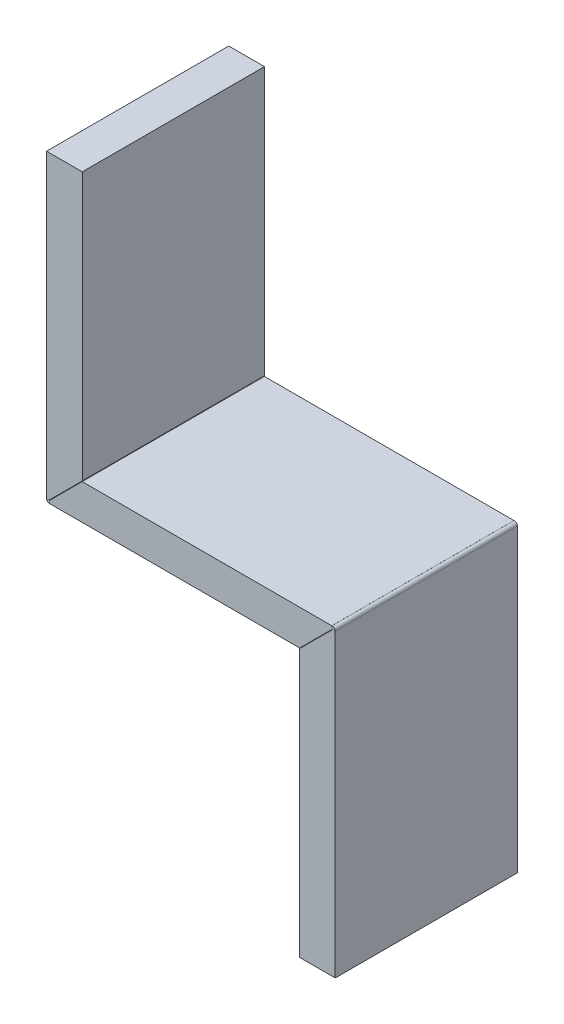
ISO-10303-21;
HEADER;
FILE_DESCRIPTION(('STEP AP214'),'2;1');
FILE_NAME('part.step','',(''),(''),'','','');
FILE_SCHEMA(('AUTOMOTIVE_DESIGN { 1 0 10303 214 1 1 1 1 }'));
ENDSEC;
DATA;
#1=APPLICATION_CONTEXT('core data for automotive mechanical design processes');
#2=APPLICATION_PROTOCOL_DEFINITION('international standard','automotive_design',2000,#1);
#3=PRODUCT_CONTEXT('',#1,'mechanical');
#4=PRODUCT('Part','Part','',(#3));
#5=PRODUCT_RELATED_PRODUCT_CATEGORY('part','',(#4));
#6=PRODUCT_DEFINITION_FORMATION('','',#4);
#7=PRODUCT_DEFINITION_CONTEXT('part definition',#1,'design');
#8=PRODUCT_DEFINITION('design','',#6,#7);
#9=PRODUCT_DEFINITION_SHAPE('','',#8);
#10=(LENGTH_UNIT() NAMED_UNIT(*) SI_UNIT(.MILLI.,.METRE.));
#11=(NAMED_UNIT(*) PLANE_ANGLE_UNIT() SI_UNIT($,.RADIAN.));
#12=(NAMED_UNIT(*) SI_UNIT($,.STERADIAN.) SOLID_ANGLE_UNIT());
#13=UNCERTAINTY_MEASURE_WITH_UNIT(LENGTH_MEASURE(1.E-05),#10,'distance_accuracy_value','');
#14=(GEOMETRIC_REPRESENTATION_CONTEXT(3) GLOBAL_UNCERTAINTY_ASSIGNED_CONTEXT((#13)) GLOBAL_UNIT_ASSIGNED_CONTEXT((#10,
#11,#12)) REPRESENTATION_CONTEXT('',''));
#15=CARTESIAN_POINT('',(0.,0.,0.));
#16=DIRECTION('',(0.,0.,1.));
#17=DIRECTION('',(1.,0.,0.));
#18=AXIS2_PLACEMENT_3D('',#15,#16,#17);
#19=CARTESIAN_POINT('',(0.0913976183315616,-4.99476189853523,1.));
#20=DIRECTION('',(-0.114247022914439,0.993452373169035,0.));
#21=DIRECTION('',(-0.993452373169035,-0.114247022914439,0.));
#22=AXIS2_PLACEMENT_3D('',#19,#20,#21);
#23=PLANE('',#22);
#24=DIRECTION('',(0.993452373169035,0.114247022914439,0.));
#25=VECTOR('',#24,1.);
#26=CARTESIAN_POINT('',(0.0913976183315616,-4.99476189853523,-50.));
#27=LINE('',#26,#25);
#28=CARTESIAN_POINT('',(0.102540088560706,-4.99348051445888,-50.));
#29=VERTEX_POINT('',#28);
#30=CARTESIAN_POINT('',(0.189496610299924,-4.98348051445888,-50.));
#31=VERTEX_POINT('',#30);
#32=EDGE_CURVE('E326',#29,#31,#27,.T.);
#33=ORIENTED_EDGE('',*,*,#32,.T.);
#34=DIRECTION('',(0.,0.,1.));
#35=VECTOR('',#34,1.);
#36=CARTESIAN_POINT('',(0.189496610299924,-4.98348051445888,-134.533631884125));
#37=LINE('',#36,#35);
#38=CARTESIAN_POINT('',(0.189496610299924,-4.98348051445888,1.));
#39=VERTEX_POINT('',#38);
#40=EDGE_CURVE('E248',#31,#39,#37,.T.);
#41=ORIENTED_EDGE('',*,*,#40,.T.);
#42=DIRECTION('',(0.993452373169035,0.114247022914439,0.));
#43=VECTOR('',#42,1.);
#44=CARTESIAN_POINT('',(0.0913976183315616,-4.99476189853523,1.));
#45=LINE('',#44,#43);
#46=CARTESIAN_POINT('',(0.102540088560706,-4.99348051445888,1.));
#47=VERTEX_POINT('',#46);
#48=EDGE_CURVE('E359',#47,#39,#45,.T.);
#49=ORIENTED_EDGE('',*,*,#48,.F.);
#50=DIRECTION('',(0.,0.,-1.));
#51=VECTOR('',#50,1.);
#52=CARTESIAN_POINT('',(0.102540088560706,-4.99348051445888,1.));
#53=LINE('',#52,#51);
#54=EDGE_CURVE('E370',#47,#29,#53,.T.);
#55=ORIENTED_EDGE('',*,*,#54,.T.);
#56=EDGE_LOOP('',(#33,#41,#49,#55));
#57=FACE_BOUND('',#56,.T.);
#58=ADVANCED_FACE('F37',(#57),#23,.F.);
#59=CARTESIAN_POINT('',(0.,-4.2,1.));
#60=DIRECTION('',(-0.114247022914439,0.993452373169035,0.));
#61=DIRECTION('',(-0.993452373169035,-0.114247022914439,0.));
#62=AXIS2_PLACEMENT_3D('',#59,#60,#61);
#63=PLANE('',#62);
#64=DIRECTION('',(0.,0.,1.));
#65=VECTOR('',#64,1.);
#66=CARTESIAN_POINT('',(0.0707496126192965,-4.19186379454878,-50.));
#67=LINE('',#66,#65);
#68=CARTESIAN_POINT('',(0.0707496126192966,-4.19186379454878,-50.));
#69=VERTEX_POINT('',#68);
#70=CARTESIAN_POINT('',(0.0707496126192966,-4.19186379454878,1.));
#71=VERTEX_POINT('',#70);
#72=EDGE_CURVE('E272',#69,#71,#67,.T.);
#73=ORIENTED_EDGE('',*,*,#72,.F.);
#74=DIRECTION('',(0.993452373169035,0.114247022914439,0.));
#75=VECTOR('',#74,1.);
#76=CARTESIAN_POINT('',(0.,-4.2,-50.));
#77=LINE('',#76,#75);
#78=CARTESIAN_POINT('',(0.0111424702291546,-4.19871861592365,-50.));
#79=VERTEX_POINT('',#78);
#80=EDGE_CURVE('E309',#79,#69,#77,.T.);
#81=ORIENTED_EDGE('',*,*,#80,.F.);
#82=DIRECTION('',(0.,0.,-1.));
#83=VECTOR('',#82,1.);
#84=CARTESIAN_POINT('',(0.0111424702291546,-4.19871861592365,1.));
#85=LINE('',#84,#83);
#86=CARTESIAN_POINT('',(0.0111424702291546,-4.19871861592365,1.));
#87=VERTEX_POINT('',#86);
#88=EDGE_CURVE('E381',#87,#79,#85,.T.);
#89=ORIENTED_EDGE('',*,*,#88,.F.);
#90=DIRECTION('',(0.993452373169035,0.114247022914439,0.));
#91=VECTOR('',#90,1.);
#92=CARTESIAN_POINT('',(0.,-4.2,1.));
#93=LINE('',#92,#91);
#94=EDGE_CURVE('E343',#87,#71,#93,.T.);
#95=ORIENTED_EDGE('',*,*,#94,.T.);
#96=EDGE_LOOP('',(#73,#81,#89,#95));
#97=FACE_BOUND('',#96,.T.);
#98=ADVANCED_FACE('F425',(#97),#63,.T.);
#99=CARTESIAN_POINT('',(0.0111424702291546,-4.19871861592365,1.));
#100=DIRECTION('',(0.,0.,1.));
#101=DIRECTION('',(1.,0.,0.));
#102=AXIS2_PLACEMENT_3D('',#99,#100,#101);
#103=PLANE('',#102);
#104=DIRECTION('',(0.114247022914439,-0.993452373169035,0.));
#105=VECTOR('',#104,1.);
#106=CARTESIAN_POINT('',(0.0111424702291546,-4.19871861592365,1.));
#107=LINE('',#106,#105);
#108=EDGE_CURVE('E11',#87,#47,#107,.T.);
#109=ORIENTED_EDGE('',*,*,#108,.F.);
#110=CARTESIAN_POINT('',(0.0100000000000104,-4.18878409219196,1.));
#111=DIRECTION('',(0.,0.,-1.));
#112=DIRECTION('',(-1.,0.,0.));
#113=AXIS2_PLACEMENT_3D('',#110,#111,#112);
#114=CIRCLE('',#113,0.01);
#115=CARTESIAN_POINT('',(0.,-4.18878409219196,1.));
#116=VERTEX_POINT('',#115);
#117=EDGE_CURVE('E345',#116,#87,#114,.F.);
#118=ORIENTED_EDGE('',*,*,#117,.F.);
#119=DIRECTION('',(1.,2.60208521396521E-13,0.));
#120=VECTOR('',#119,1.);
#121=CARTESIAN_POINT('',(-0.79999999999999,-4.18878409219217,1.));
#122=LINE('',#121,#120);
#123=CARTESIAN_POINT('',(-0.79999999999999,-4.18878409219217,1.));
#124=VERTEX_POINT('',#123);
#125=EDGE_CURVE('E45',#124,#116,#122,.T.);
#126=ORIENTED_EDGE('',*,*,#125,.F.);
#127=CARTESIAN_POINT('',(0.0100000000000104,-4.18878409219196,1.));
#128=DIRECTION('',(0.,0.,1.));
#129=DIRECTION('',(1.,0.,0.));
#130=AXIS2_PLACEMENT_3D('',#127,#128,#129);
#131=CIRCLE('',#130,0.81);
#132=EDGE_CURVE('E355',#124,#47,#131,.T.);
#133=ORIENTED_EDGE('',*,*,#132,.T.);
#134=EDGE_LOOP('',(#109,#118,#126,#133));
#135=FACE_BOUND('',#134,.T.);
#136=ADVANCED_FACE('F39',(#135),#103,.T.);
#137=CARTESIAN_POINT('',(-0.79999999999999,-4.18878409219217,1.));
#138=DIRECTION('',(0.,0.,1.));
#139=DIRECTION('',(1.,0.,0.));
#140=AXIS2_PLACEMENT_3D('',#137,#138,#139);
#141=PLANE('',#140);
#142=ORIENTED_EDGE('',*,*,#94,.F.);
#143=ORIENTED_EDGE('',*,*,#108,.T.);
#144=ORIENTED_EDGE('',*,*,#48,.T.);
#145=DIRECTION('',(0.,-1.,0.));
#146=VECTOR('',#145,1.);
#147=CARTESIAN_POINT('',(0.189496610299924,-4.98348051445888,1.));
#148=LINE('',#147,#146);
#149=CARTESIAN_POINT('',(0.189496610299924,-4.99348051445888,1.));
#150=VERTEX_POINT('',#149);
#151=EDGE_CURVE('E227',#39,#150,#148,.T.);
#152=ORIENTED_EDGE('',*,*,#151,.T.);
#153=DIRECTION('',(1.,0.,0.));
#154=VECTOR('',#153,1.);
#155=CARTESIAN_POINT('',(0.189496610299924,-4.99348051445888,1.));
#156=LINE('',#155,#154);
#157=CARTESIAN_POINT('',(70.0408310240318,-4.99348051445888,1.));
#158=VERTEX_POINT('',#157);
#159=EDGE_CURVE('E232',#150,#158,#156,.T.);
#160=ORIENTED_EDGE('',*,*,#159,.T.);
#161=DIRECTION('',(0.707106781186543,0.707106781186552,0.));
#162=VECTOR('',#161,1.);
#163=CARTESIAN_POINT('',(70.0408310240318,-4.99348051445888,1.));
#164=LINE('',#163,#162);
#165=CARTESIAN_POINT('',(79.1288575297708,4.09454599128029,1.));
#166=VERTEX_POINT('',#165);
#167=EDGE_CURVE('E228',#158,#166,#164,.T.);
#168=ORIENTED_EDGE('',*,*,#167,.T.);
#169=CARTESIAN_POINT('',(79.1888575297708,4.10144599128029,1.));
#170=VERTEX_POINT('',#169);
#171=EDGE_CURVE('E358',#166,#170,#45,.T.);
#172=ORIENTED_EDGE('',*,*,#171,.T.);
#173=DIRECTION('',(-0.114247022914484,0.99345237316903,0.));
#174=VECTOR('',#173,1.);
#175=CARTESIAN_POINT('',(79.1888575297708,4.10144599128029,1.));
#176=LINE('',#175,#174);
#177=CARTESIAN_POINT('',(79.0974599114393,4.89620788981551,1.));
#178=VERTEX_POINT('',#177);
#179=EDGE_CURVE('E397',#170,#178,#176,.T.);
#180=ORIENTED_EDGE('',*,*,#179,.T.);
#181=CARTESIAN_POINT('',(79.0105033897001,4.88620788981551,1.));
#182=VERTEX_POINT('',#181);
#183=EDGE_CURVE('E342',#182,#178,#93,.T.);
#184=ORIENTED_EDGE('',*,*,#183,.F.);
#185=DIRECTION('',(0.,1.,0.));
#186=VECTOR('',#185,1.);
#187=CARTESIAN_POINT('',(79.0105033897001,4.89620788981551,1.));
#188=LINE('',#187,#186);
#189=CARTESIAN_POINT('',(79.0105033897001,4.89620788981551,1.));
#190=VERTEX_POINT('',#189);
#191=EDGE_CURVE('E253',#182,#190,#188,.T.);
#192=ORIENTED_EDGE('',*,*,#191,.T.);
#193=DIRECTION('',(-1.,0.,0.));
#194=VECTOR('',#193,1.);
#195=CARTESIAN_POINT('',(9.1588212969835,4.89620788981551,1.));
#196=LINE('',#195,#194);
#197=CARTESIAN_POINT('',(9.1588212969835,4.89620788981551,1.));
#198=VERTEX_POINT('',#197);
#199=EDGE_CURVE('E267',#190,#198,#196,.T.);
#200=ORIENTED_EDGE('',*,*,#199,.T.);
#201=DIRECTION('',(-0.707106781186544,-0.707106781186551,0.));
#202=VECTOR('',#201,1.);
#203=CARTESIAN_POINT('',(0.0707496126192965,-4.19186379454878,1.));
#204=LINE('',#203,#202);
#205=EDGE_CURVE('E258',#198,#71,#204,.T.);
#206=ORIENTED_EDGE('',*,*,#205,.T.);
#207=EDGE_LOOP('',(#142,#143,#144,#152,#160,#168,#172,#180,#184,#192,#200,#206));
#208=FACE_BOUND('',#207,.T.);
#209=ADVANCED_FACE('F426',(#208),#141,.T.);
#210=CARTESIAN_POINT('',(0.,-4.18878409219196,-50.));
#211=DIRECTION('',(0.,0.,-1.));
#212=DIRECTION('',(-1.,0.,0.));
#213=AXIS2_PLACEMENT_3D('',#210,#211,#212);
#214=PLANE('',#213);
#215=DIRECTION('',(-1.,-2.60208521396521E-13,0.));
#216=VECTOR('',#215,1.);
#217=CARTESIAN_POINT('',(0.,-4.18878409219196,-50.));
#218=LINE('',#217,#216);
#219=CARTESIAN_POINT('',(0.,-4.18878409219196,-50.));
#220=VERTEX_POINT('',#219);
#221=CARTESIAN_POINT('',(-0.79999999999999,-4.18878409219217,-50.));
#222=VERTEX_POINT('',#221);
#223=EDGE_CURVE('E404',#220,#222,#218,.T.);
#224=ORIENTED_EDGE('',*,*,#223,.F.);
#225=CARTESIAN_POINT('',(0.0100000000000104,-4.18878409219196,-50.));
#226=DIRECTION('',(0.,0.,-1.));
#227=DIRECTION('',(-1.,0.,0.));
#228=AXIS2_PLACEMENT_3D('',#225,#226,#227);
#229=CIRCLE('',#228,0.01);
#230=EDGE_CURVE('E312',#220,#79,#229,.F.);
#231=ORIENTED_EDGE('',*,*,#230,.T.);
#232=DIRECTION('',(-0.114247022914439,0.993452373169035,0.));
#233=VECTOR('',#232,1.);
#234=CARTESIAN_POINT('',(0.102540088560706,-4.99348051445888,-50.));
#235=LINE('',#234,#233);
#236=EDGE_CURVE('E402',#29,#79,#235,.T.);
#237=ORIENTED_EDGE('',*,*,#236,.F.);
#238=CARTESIAN_POINT('',(0.0100000000000104,-4.18878409219196,-50.));
#239=DIRECTION('',(0.,0.,1.));
#240=DIRECTION('',(1.,0.,0.));
#241=AXIS2_PLACEMENT_3D('',#238,#239,#240);
#242=CIRCLE('',#241,0.81);
#243=EDGE_CURVE('E322',#222,#29,#242,.T.);
#244=ORIENTED_EDGE('',*,*,#243,.F.);
#245=EDGE_LOOP('',(#224,#231,#237,#244));
#246=FACE_BOUND('',#245,.T.);
#247=ADVANCED_FACE('F439',(#246),#214,.T.);
#248=CARTESIAN_POINT('',(0.102540088560706,-4.99348051445888,-50.));
#249=DIRECTION('',(0.,0.,-1.));
#250=DIRECTION('',(-1.,0.,0.));
#251=AXIS2_PLACEMENT_3D('',#248,#249,#250);
#252=PLANE('',#251);
#253=DIRECTION('',(1.,0.,0.));
#254=VECTOR('',#253,1.);
#255=CARTESIAN_POINT('',(-0.800000000000004,80.,-50.));
#256=LINE('',#255,#254);
#257=CARTESIAN_POINT('',(-0.800000000000004,80.,-50.));
#258=VERTEX_POINT('',#257);
#259=CARTESIAN_POINT('',(9.2,80.,-50.));
#260=VERTEX_POINT('',#259);
#261=EDGE_CURVE('E317',#258,#260,#256,.T.);
#262=ORIENTED_EDGE('',*,*,#261,.T.);
#263=DIRECTION('',(0.,1.,0.));
#264=VECTOR('',#263,1.);
#265=CARTESIAN_POINT('',(9.2,80.,-50.));
#266=LINE('',#265,#264);
#267=CARTESIAN_POINT('',(9.2,5.07121590780815,-50.));
#268=VERTEX_POINT('',#267);
#269=EDGE_CURVE('E285',#268,#260,#266,.T.);
#270=ORIENTED_EDGE('',*,*,#269,.F.);
#271=DIRECTION('',(0.707106781186543,0.707106781186552,0.));
#272=VECTOR('',#271,1.);
#273=CARTESIAN_POINT('',(9.2,5.07121590780815,-50.));
#274=LINE('',#273,#272);
#275=CARTESIAN_POINT('',(0.,-4.12878409219196,-50.));
#276=VERTEX_POINT('',#275);
#277=EDGE_CURVE('E282',#276,#268,#274,.T.);
#278=ORIENTED_EDGE('',*,*,#277,.F.);
#279=DIRECTION('',(0.,-1.,0.));
#280=VECTOR('',#279,1.);
#281=CARTESIAN_POINT('',(0.,80.,-50.));
#282=LINE('',#281,#280);
#283=EDGE_CURVE('E315',#276,#220,#282,.T.);
#284=ORIENTED_EDGE('',*,*,#283,.T.);
#285=ORIENTED_EDGE('',*,*,#223,.T.);
#286=DIRECTION('',(0.,-1.,0.));
#287=VECTOR('',#286,1.);
#288=CARTESIAN_POINT('',(-0.800000000000004,80.,-50.));
#289=LINE('',#288,#287);
#290=EDGE_CURVE('E319',#258,#222,#289,.T.);
#291=ORIENTED_EDGE('',*,*,#290,.F.);
#292=EDGE_LOOP('',(#262,#270,#278,#284,#285,#291));
#293=FACE_BOUND('',#292,.T.);
#294=ADVANCED_FACE('F449',(#293),#252,.T.);
#295=CARTESIAN_POINT('',(80.,4.0915114675486,1.));
#296=DIRECTION('',(0.,0.,1.));
#297=DIRECTION('',(1.,0.,0.));
#298=AXIS2_PLACEMENT_3D('',#295,#296,#297);
#299=PLANE('',#298);
#300=DIRECTION('',(-1.,0.,0.));
#301=VECTOR('',#300,1.);
#302=CARTESIAN_POINT('',(80.,4.0915114675486,1.));
#303=LINE('',#302,#301);
#304=CARTESIAN_POINT('',(80.,4.0915114675486,1.));
#305=VERTEX_POINT('',#304);
#306=CARTESIAN_POINT('',(79.2,4.0915114675486,1.));
#307=VERTEX_POINT('',#306);
#308=EDGE_CURVE('E400',#305,#307,#303,.T.);
#309=ORIENTED_EDGE('',*,*,#308,.F.);
#310=CARTESIAN_POINT('',(79.19,4.0915114675486,1.));
#311=DIRECTION('',(0.,0.,1.));
#312=DIRECTION('',(1.,0.,0.));
#313=AXIS2_PLACEMENT_3D('',#310,#311,#312);
#314=CIRCLE('',#313,0.81);
#315=EDGE_CURVE('E339',#178,#305,#314,.F.);
#316=ORIENTED_EDGE('',*,*,#315,.F.);
#317=ORIENTED_EDGE('',*,*,#179,.F.);
#318=CARTESIAN_POINT('',(79.19,4.0915114675486,1.));
#319=DIRECTION('',(0.,0.,1.));
#320=DIRECTION('',(1.,0.,0.));
#321=AXIS2_PLACEMENT_3D('',#318,#319,#320);
#322=CIRCLE('',#321,0.01);
#323=EDGE_CURVE('E362',#170,#307,#322,.F.);
#324=ORIENTED_EDGE('',*,*,#323,.T.);
#325=EDGE_LOOP('',(#309,#316,#317,#324));
#326=FACE_BOUND('',#325,.T.);
#327=ADVANCED_FACE('F499',(#326),#299,.T.);
#328=CARTESIAN_POINT('',(79.1888575297708,4.10144599128029,1.));
#329=DIRECTION('',(0.,0.,1.));
#330=DIRECTION('',(1.,0.,0.));
#331=AXIS2_PLACEMENT_3D('',#328,#329,#330);
#332=PLANE('',#331);
#333=DIRECTION('',(0.,-1.,0.));
#334=VECTOR('',#333,1.);
#335=CARTESIAN_POINT('',(80.,5.,1.));
#336=LINE('',#335,#334);
#337=CARTESIAN_POINT('',(80.,-80.,1.));
#338=VERTEX_POINT('',#337);
#339=EDGE_CURVE('E336',#305,#338,#336,.T.);
#340=ORIENTED_EDGE('',*,*,#339,.F.);
#341=ORIENTED_EDGE('',*,*,#308,.T.);
#342=DIRECTION('',(0.,-1.,0.));
#343=VECTOR('',#342,1.);
#344=CARTESIAN_POINT('',(79.2,5.,1.));
#345=LINE('',#344,#343);
#346=CARTESIAN_POINT('',(79.2,4.0315114675486,1.));
#347=VERTEX_POINT('',#346);
#348=EDGE_CURVE('E332',#307,#347,#345,.T.);
#349=ORIENTED_EDGE('',*,*,#348,.T.);
#350=DIRECTION('',(-0.707106781186543,-0.707106781186551,0.));
#351=VECTOR('',#350,1.);
#352=CARTESIAN_POINT('',(79.2,4.0315114675486,1.));
#353=LINE('',#352,#351);
#354=CARTESIAN_POINT('',(70.,-5.1684885324515,1.));
#355=VERTEX_POINT('',#354);
#356=EDGE_CURVE('E221',#347,#355,#353,.T.);
#357=ORIENTED_EDGE('',*,*,#356,.T.);
#358=DIRECTION('',(0.,-1.,0.));
#359=VECTOR('',#358,1.);
#360=CARTESIAN_POINT('',(70.,-5.1684885324515,1.));
#361=LINE('',#360,#359);
#362=CARTESIAN_POINT('',(70.,-80.,1.));
#363=VERTEX_POINT('',#362);
#364=EDGE_CURVE('E214',#355,#363,#361,.T.);
#365=ORIENTED_EDGE('',*,*,#364,.T.);
#366=DIRECTION('',(-1.,0.,0.));
#367=VECTOR('',#366,1.);
#368=CARTESIAN_POINT('',(80.,-80.,1.));
#369=LINE('',#368,#367);
#370=EDGE_CURVE('E334',#338,#363,#369,.T.);
#371=ORIENTED_EDGE('',*,*,#370,.F.);
#372=EDGE_LOOP('',(#340,#341,#349,#357,#365,#371));
#373=FACE_BOUND('',#372,.T.);
#374=ADVANCED_FACE('F521',(#373),#332,.T.);
#375=CARTESIAN_POINT('',(79.0974599114393,4.89620788981551,-50.));
#376=DIRECTION('',(0.,0.,-1.));
#377=DIRECTION('',(-1.,0.,0.));
#378=AXIS2_PLACEMENT_3D('',#375,#376,#377);
#379=PLANE('',#378);
#380=DIRECTION('',(0.114247022914484,-0.99345237316903,0.));
#381=VECTOR('',#380,1.);
#382=CARTESIAN_POINT('',(79.0974599114393,4.89620788981551,-50.));
#383=LINE('',#382,#381);
#384=CARTESIAN_POINT('',(79.0974599114393,4.89620788981551,-50.));
#385=VERTEX_POINT('',#384);
#386=CARTESIAN_POINT('',(79.1888575297708,4.10144599128029,-50.));
#387=VERTEX_POINT('',#386);
#388=EDGE_CURVE('E394',#385,#387,#383,.T.);
#389=ORIENTED_EDGE('',*,*,#388,.F.);
#390=CARTESIAN_POINT('',(79.19,4.0915114675486,-50.));
#391=DIRECTION('',(0.,0.,1.));
#392=DIRECTION('',(1.,0.,0.));
#393=AXIS2_PLACEMENT_3D('',#390,#391,#392);
#394=CIRCLE('',#393,0.81);
#395=CARTESIAN_POINT('',(80.,4.0915114675486,-50.));
#396=VERTEX_POINT('',#395);
#397=EDGE_CURVE('E305',#385,#396,#394,.F.);
#398=ORIENTED_EDGE('',*,*,#397,.T.);
#399=DIRECTION('',(1.,0.,0.));
#400=VECTOR('',#399,1.);
#401=CARTESIAN_POINT('',(79.2,4.0915114675486,-50.));
#402=LINE('',#401,#400);
#403=CARTESIAN_POINT('',(79.2,4.0915114675486,-50.));
#404=VERTEX_POINT('',#403);
#405=EDGE_CURVE('E392',#404,#396,#402,.T.);
#406=ORIENTED_EDGE('',*,*,#405,.F.);
#407=CARTESIAN_POINT('',(79.19,4.0915114675486,-50.));
#408=DIRECTION('',(0.,0.,1.));
#409=DIRECTION('',(1.,0.,0.));
#410=AXIS2_PLACEMENT_3D('',#407,#408,#409);
#411=CIRCLE('',#410,0.01);
#412=EDGE_CURVE('E329',#387,#404,#411,.F.);
#413=ORIENTED_EDGE('',*,*,#412,.F.);
#414=EDGE_LOOP('',(#389,#398,#406,#413));
#415=FACE_BOUND('',#414,.T.);
#416=ADVANCED_FACE('F516',(#415),#379,.T.);
#417=CARTESIAN_POINT('',(79.2,4.0915114675486,-50.));
#418=DIRECTION('',(0.,0.,-1.));
#419=DIRECTION('',(-1.,0.,0.));
#420=AXIS2_PLACEMENT_3D('',#417,#418,#419);
#421=PLANE('',#420);
#422=ORIENTED_EDGE('',*,*,#80,.T.);
#423=DIRECTION('',(-0.707106781186544,-0.707106781186551,0.));
#424=VECTOR('',#423,1.);
#425=CARTESIAN_POINT('',(0.0707496126192965,-4.19186379454878,-50.));
#426=LINE('',#425,#424);
#427=CARTESIAN_POINT('',(9.1588212969835,4.89620788981551,-50.));
#428=VERTEX_POINT('',#427);
#429=EDGE_CURVE('E261',#428,#69,#426,.T.);
#430=ORIENTED_EDGE('',*,*,#429,.F.);
#431=DIRECTION('',(-1.,0.,0.));
#432=VECTOR('',#431,1.);
#433=CARTESIAN_POINT('',(9.1588212969835,4.89620788981551,-50.));
#434=LINE('',#433,#432);
#435=CARTESIAN_POINT('',(79.0105033897001,4.89620788981551,-50.));
#436=VERTEX_POINT('',#435);
#437=EDGE_CURVE('E257',#436,#428,#434,.T.);
#438=ORIENTED_EDGE('',*,*,#437,.F.);
#439=DIRECTION('',(0.,1.,0.));
#440=VECTOR('',#439,1.);
#441=CARTESIAN_POINT('',(79.0105033897001,4.89620788981551,-50.));
#442=LINE('',#441,#440);
#443=CARTESIAN_POINT('',(79.0105033897001,4.88620788981551,-50.));
#444=VERTEX_POINT('',#443);
#445=EDGE_CURVE('E254',#444,#436,#442,.T.);
#446=ORIENTED_EDGE('',*,*,#445,.F.);
#447=EDGE_CURVE('E308',#444,#385,#77,.T.);
#448=ORIENTED_EDGE('',*,*,#447,.T.);
#449=ORIENTED_EDGE('',*,*,#388,.T.);
#450=CARTESIAN_POINT('',(79.1288575297709,4.09454599128029,-50.));
#451=VERTEX_POINT('',#450);
#452=EDGE_CURVE('E325',#451,#387,#27,.T.);
#453=ORIENTED_EDGE('',*,*,#452,.F.);
#454=DIRECTION('',(0.707106781186543,0.707106781186552,0.));
#455=VECTOR('',#454,1.);
#456=CARTESIAN_POINT('',(70.0408310240318,-4.99348051445888,-50.));
#457=LINE('',#456,#455);
#458=CARTESIAN_POINT('',(70.0408310240318,-4.99348051445888,-50.));
#459=VERTEX_POINT('',#458);
#460=EDGE_CURVE('E240',#459,#451,#457,.T.);
#461=ORIENTED_EDGE('',*,*,#460,.F.);
#462=DIRECTION('',(1.,0.,0.));
#463=VECTOR('',#462,1.);
#464=CARTESIAN_POINT('',(0.189496610299924,-4.99348051445888,-50.));
#465=LINE('',#464,#463);
#466=CARTESIAN_POINT('',(0.189496610299924,-4.99348051445888,-50.));
#467=VERTEX_POINT('',#466);
#468=EDGE_CURVE('E244',#467,#459,#465,.T.);
#469=ORIENTED_EDGE('',*,*,#468,.F.);
#470=DIRECTION('',(0.,-1.,0.));
#471=VECTOR('',#470,1.);
#472=CARTESIAN_POINT('',(0.189496610299924,-4.98348051445888,-50.));
#473=LINE('',#472,#471);
#474=EDGE_CURVE('E231',#31,#467,#473,.T.);
#475=ORIENTED_EDGE('',*,*,#474,.F.);
#476=ORIENTED_EDGE('',*,*,#32,.F.);
#477=ORIENTED_EDGE('',*,*,#236,.T.);
#478=EDGE_LOOP('',(#422,#430,#438,#446,#448,#449,#453,#461,#469,#475,#476,#477));
#479=FACE_BOUND('',#478,.T.);
#480=ADVANCED_FACE('F433',(#479),#421,.T.);
#481=CARTESIAN_POINT('',(79.2,5.,1.));
#482=DIRECTION('',(1.,0.,0.));
#483=DIRECTION('',(0.,1.,0.));
#484=AXIS2_PLACEMENT_3D('',#481,#482,#483);
#485=PLANE('',#484);
#486=DIRECTION('',(0.,-1.,0.));
#487=VECTOR('',#486,1.);
#488=CARTESIAN_POINT('',(79.2,5.,-50.));
#489=LINE('',#488,#487);
#490=CARTESIAN_POINT('',(79.2,4.0315114675486,-50.));
#491=VERTEX_POINT('',#490);
#492=EDGE_CURVE('E57',#404,#491,#489,.T.);
#493=ORIENTED_EDGE('',*,*,#492,.T.);
#494=DIRECTION('',(0.,0.,1.));
#495=VECTOR('',#494,1.);
#496=CARTESIAN_POINT('',(79.2,4.0315114675486,-134.533631884125));
#497=LINE('',#496,#495);
#498=EDGE_CURVE('E52',#491,#347,#497,.T.);
#499=ORIENTED_EDGE('',*,*,#498,.T.);
#500=ORIENTED_EDGE('',*,*,#348,.F.);
#501=DIRECTION('',(0.,0.,-1.));
#502=VECTOR('',#501,1.);
#503=CARTESIAN_POINT('',(79.2,4.0915114675486,1.));
#504=LINE('',#503,#502);
#505=EDGE_CURVE('E365',#307,#404,#504,.T.);
#506=ORIENTED_EDGE('',*,*,#505,.T.);
#507=EDGE_LOOP('',(#493,#499,#500,#506));
#508=FACE_BOUND('',#507,.T.);
#509=ADVANCED_FACE('F518',(#508),#485,.F.);
#510=CARTESIAN_POINT('',(80.,-80.,1.));
#511=DIRECTION('',(0.,-1.,0.));
#512=DIRECTION('',(0.,0.,-1.));
#513=AXIS2_PLACEMENT_3D('',#510,#511,#512);
#514=PLANE('',#513);
#515=ORIENTED_EDGE('',*,*,#370,.T.);
#516=DIRECTION('',(0.,0.,1.));
#517=VECTOR('',#516,1.);
#518=CARTESIAN_POINT('',(70.,-80.,-134.533631884125));
#519=LINE('',#518,#517);
#520=CARTESIAN_POINT('',(70.,-80.,-50.));
#521=VERTEX_POINT('',#520);
#522=EDGE_CURVE('E208',#521,#363,#519,.T.);
#523=ORIENTED_EDGE('',*,*,#522,.F.);
#524=DIRECTION('',(-1.,0.,0.));
#525=VECTOR('',#524,1.);
#526=CARTESIAN_POINT('',(80.,-80.,-50.));
#527=LINE('',#526,#525);
#528=CARTESIAN_POINT('',(80.,-80.,-50.));
#529=VERTEX_POINT('',#528);
#530=EDGE_CURVE('E204',#529,#521,#527,.T.);
#531=ORIENTED_EDGE('',*,*,#530,.F.);
#532=DIRECTION('',(0.,0.,-1.));
#533=VECTOR('',#532,1.);
#534=CARTESIAN_POINT('',(80.,-80.,1.));
#535=LINE('',#534,#533);
#536=EDGE_CURVE('E390',#338,#529,#535,.T.);
#537=ORIENTED_EDGE('',*,*,#536,.F.);
#538=EDGE_LOOP('',(#515,#523,#531,#537));
#539=FACE_BOUND('',#538,.T.);
#540=ADVANCED_FACE('F526',(#539),#514,.T.);
#541=CARTESIAN_POINT('',(80.,5.,1.));
#542=DIRECTION('',(1.,0.,0.));
#543=DIRECTION('',(0.,1.,0.));
#544=AXIS2_PLACEMENT_3D('',#541,#542,#543);
#545=PLANE('',#544);
#546=ORIENTED_EDGE('',*,*,#536,.T.);
#547=DIRECTION('',(0.,-1.,0.));
#548=VECTOR('',#547,1.);
#549=CARTESIAN_POINT('',(80.,5.,-50.));
#550=LINE('',#549,#548);
#551=EDGE_CURVE('E303',#396,#529,#550,.T.);
#552=ORIENTED_EDGE('',*,*,#551,.F.);
#553=DIRECTION('',(0.,0.,-1.));
#554=VECTOR('',#553,1.);
#555=CARTESIAN_POINT('',(80.,4.0915114675486,1.));
#556=LINE('',#555,#554);
#557=EDGE_CURVE('E387',#305,#396,#556,.T.);
#558=ORIENTED_EDGE('',*,*,#557,.F.);
#559=ORIENTED_EDGE('',*,*,#339,.T.);
#560=EDGE_LOOP('',(#546,#552,#558,#559));
#561=FACE_BOUND('',#560,.T.);
#562=ADVANCED_FACE('F524',(#561),#545,.T.);
#563=CARTESIAN_POINT('',(79.19,4.0915114675486,1.));
#564=DIRECTION('',(0.,0.,-1.));
#565=DIRECTION('',(-1.,0.,0.));
#566=AXIS2_PLACEMENT_3D('',#563,#564,#565);
#567=CYLINDRICAL_SURFACE('',#566,0.81);
#568=ORIENTED_EDGE('',*,*,#557,.T.);
#569=ORIENTED_EDGE('',*,*,#397,.F.);
#570=DIRECTION('',(0.,0.,-1.));
#571=VECTOR('',#570,1.);
#572=CARTESIAN_POINT('',(79.0974599114393,4.89620788981551,1.));
#573=LINE('',#572,#571);
#574=EDGE_CURVE('E384',#178,#385,#573,.T.);
#575=ORIENTED_EDGE('',*,*,#574,.F.);
#576=ORIENTED_EDGE('',*,*,#315,.T.);
#577=EDGE_LOOP('',(#568,#569,#575,#576));
#578=FACE_BOUND('',#577,.T.);
#579=ADVANCED_FACE('F503',(#578),#567,.T.);
#580=DIRECTION('',(0.,0.,1.));
#581=VECTOR('',#580,1.);
#582=CARTESIAN_POINT('',(79.0105033897001,4.88620788981551,-50.));
#583=LINE('',#582,#581);
#584=EDGE_CURVE('E264',#444,#182,#583,.T.);
#585=ORIENTED_EDGE('',*,*,#584,.T.);
#586=ORIENTED_EDGE('',*,*,#183,.T.);
#587=ORIENTED_EDGE('',*,*,#574,.T.);
#588=ORIENTED_EDGE('',*,*,#447,.F.);
#589=EDGE_LOOP('',(#585,#586,#587,#588));
#590=FACE_BOUND('',#589,.T.);
#591=ADVANCED_FACE('F478',(#590),#63,.T.);
#592=CARTESIAN_POINT('',(0.0100000000000104,-4.18878409219196,1.));
#593=DIRECTION('',(0.,0.,-1.));
#594=DIRECTION('',(-1.,0.,0.));
#595=AXIS2_PLACEMENT_3D('',#592,#593,#594);
#596=CYLINDRICAL_SURFACE('',#595,0.01);
#597=ORIENTED_EDGE('',*,*,#88,.T.);
#598=ORIENTED_EDGE('',*,*,#230,.F.);
#599=DIRECTION('',(0.,0.,-1.));
#600=VECTOR('',#599,1.);
#601=CARTESIAN_POINT('',(0.,-4.18878409219196,1.));
#602=LINE('',#601,#600);
#603=EDGE_CURVE('E378',#116,#220,#602,.T.);
#604=ORIENTED_EDGE('',*,*,#603,.F.);
#605=ORIENTED_EDGE('',*,*,#117,.T.);
#606=EDGE_LOOP('',(#597,#598,#604,#605));
#607=FACE_BOUND('',#606,.T.);
#608=ADVANCED_FACE('F416',(#607),#596,.F.);
#609=CARTESIAN_POINT('',(0.,80.,1.));
#610=DIRECTION('',(1.,0.,0.));
#611=DIRECTION('',(0.,1.,0.));
#612=AXIS2_PLACEMENT_3D('',#609,#610,#611);
#613=PLANE('',#612);
#614=DIRECTION('',(0.,0.,1.));
#615=VECTOR('',#614,1.);
#616=CARTESIAN_POINT('',(0.,-4.12878409219196,-50.));
#617=LINE('',#616,#615);
#618=CARTESIAN_POINT('',(0.,-4.12878409219196,1.));
#619=VERTEX_POINT('',#618);
#620=EDGE_CURVE('E289',#276,#619,#617,.T.);
#621=ORIENTED_EDGE('',*,*,#620,.T.);
#622=DIRECTION('',(0.,-1.,0.));
#623=VECTOR('',#622,1.);
#624=CARTESIAN_POINT('',(0.,80.,1.));
#625=LINE('',#624,#623);
#626=EDGE_CURVE('E348',#619,#116,#625,.T.);
#627=ORIENTED_EDGE('',*,*,#626,.T.);
#628=ORIENTED_EDGE('',*,*,#603,.T.);
#629=ORIENTED_EDGE('',*,*,#283,.F.);
#630=EDGE_LOOP('',(#621,#627,#628,#629));
#631=FACE_BOUND('',#630,.T.);
#632=ADVANCED_FACE('F454',(#631),#613,.T.);
#633=CARTESIAN_POINT('',(-0.800000000000004,80.,1.));
#634=DIRECTION('',(0.,1.,0.));
#635=DIRECTION('',(0.,0.,1.));
#636=AXIS2_PLACEMENT_3D('',#633,#634,#635);
#637=PLANE('',#636);
#638=DIRECTION('',(1.,0.,0.));
#639=VECTOR('',#638,1.);
#640=CARTESIAN_POINT('',(-0.800000000000004,80.,1.));
#641=LINE('',#640,#639);
#642=CARTESIAN_POINT('',(-0.800000000000004,80.,1.));
#643=VERTEX_POINT('',#642);
#644=CARTESIAN_POINT('',(9.2,80.,1.));
#645=VERTEX_POINT('',#644);
#646=EDGE_CURVE('E350',#643,#645,#641,.T.);
#647=ORIENTED_EDGE('',*,*,#646,.T.);
#648=DIRECTION('',(0.,0.,1.));
#649=VECTOR('',#648,1.);
#650=CARTESIAN_POINT('',(9.2,80.,-50.));
#651=LINE('',#650,#649);
#652=EDGE_CURVE('E294',#260,#645,#651,.T.);
#653=ORIENTED_EDGE('',*,*,#652,.F.);
#654=ORIENTED_EDGE('',*,*,#261,.F.);
#655=DIRECTION('',(0.,0.,-1.));
#656=VECTOR('',#655,1.);
#657=CARTESIAN_POINT('',(-0.800000000000004,80.,1.));
#658=LINE('',#657,#656);
#659=EDGE_CURVE('E376',#643,#258,#658,.T.);
#660=ORIENTED_EDGE('',*,*,#659,.F.);
#661=EDGE_LOOP('',(#647,#653,#654,#660));
#662=FACE_BOUND('',#661,.T.);
#663=ADVANCED_FACE('F462',(#662),#637,.T.);
#664=CARTESIAN_POINT('',(-0.800000000000004,80.,1.));
#665=DIRECTION('',(1.,0.,0.));
#666=DIRECTION('',(0.,1.,0.));
#667=AXIS2_PLACEMENT_3D('',#664,#665,#666);
#668=PLANE('',#667);
#669=ORIENTED_EDGE('',*,*,#659,.T.);
#670=ORIENTED_EDGE('',*,*,#290,.T.);
#671=DIRECTION('',(0.,0.,-1.));
#672=VECTOR('',#671,1.);
#673=CARTESIAN_POINT('',(-0.79999999999999,-4.18878409219217,1.));
#674=LINE('',#673,#672);
#675=EDGE_CURVE('E373',#124,#222,#674,.T.);
#676=ORIENTED_EDGE('',*,*,#675,.F.);
#677=DIRECTION('',(0.,-1.,0.));
#678=VECTOR('',#677,1.);
#679=CARTESIAN_POINT('',(-0.800000000000004,80.,1.));
#680=LINE('',#679,#678);
#681=EDGE_CURVE('E352',#643,#124,#680,.T.);
#682=ORIENTED_EDGE('',*,*,#681,.F.);
#683=EDGE_LOOP('',(#669,#670,#676,#682));
#684=FACE_BOUND('',#683,.T.);
#685=ADVANCED_FACE('F445',(#684),#668,.F.);
#686=CARTESIAN_POINT('',(0.0100000000000104,-4.18878409219196,1.));
#687=DIRECTION('',(0.,0.,-1.));
#688=DIRECTION('',(-1.,0.,0.));
#689=AXIS2_PLACEMENT_3D('',#686,#687,#688);
#690=CYLINDRICAL_SURFACE('',#689,0.81);
#691=ORIENTED_EDGE('',*,*,#675,.T.);
#692=ORIENTED_EDGE('',*,*,#243,.T.);
#693=ORIENTED_EDGE('',*,*,#54,.F.);
#694=ORIENTED_EDGE('',*,*,#132,.F.);
#695=EDGE_LOOP('',(#691,#692,#693,#694));
#696=FACE_BOUND('',#695,.T.);
#697=ADVANCED_FACE('F443',(#696),#690,.T.);
#698=ORIENTED_EDGE('',*,*,#171,.F.);
#699=DIRECTION('',(0.,0.,1.));
#700=VECTOR('',#699,1.);
#701=CARTESIAN_POINT('',(79.1288575297708,4.09454599128029,-134.533631884125));
#702=LINE('',#701,#700);
#703=EDGE_CURVE('E242',#451,#166,#702,.T.);
#704=ORIENTED_EDGE('',*,*,#703,.F.);
#705=ORIENTED_EDGE('',*,*,#452,.T.);
#706=DIRECTION('',(0.,0.,-1.));
#707=VECTOR('',#706,1.);
#708=CARTESIAN_POINT('',(79.1888575297708,4.10144599128029,1.));
#709=LINE('',#708,#707);
#710=EDGE_CURVE('E367',#170,#387,#709,.T.);
#711=ORIENTED_EDGE('',*,*,#710,.F.);
#712=EDGE_LOOP('',(#698,#704,#705,#711));
#713=FACE_BOUND('',#712,.T.);
#714=ADVANCED_FACE('F473',(#713),#23,.F.);
#715=CARTESIAN_POINT('',(79.19,4.0915114675486,1.));
#716=DIRECTION('',(0.,0.,-1.));
#717=DIRECTION('',(-1.,0.,0.));
#718=AXIS2_PLACEMENT_3D('',#715,#716,#717);
#719=CYLINDRICAL_SURFACE('',#718,0.01);
#720=ORIENTED_EDGE('',*,*,#710,.T.);
#721=ORIENTED_EDGE('',*,*,#412,.T.);
#722=ORIENTED_EDGE('',*,*,#505,.F.);
#723=ORIENTED_EDGE('',*,*,#323,.F.);
#724=EDGE_LOOP('',(#720,#721,#722,#723));
#725=FACE_BOUND('',#724,.T.);
#726=ADVANCED_FACE('F482',(#725),#719,.F.);
#727=CARTESIAN_POINT('',(79.19,4.0915114675486,1.));
#728=DIRECTION('',(0.,0.,1.));
#729=DIRECTION('',(1.,0.,0.));
#730=AXIS2_PLACEMENT_3D('',#727,#728,#729);
#731=PLANE('',#730);
#732=ORIENTED_EDGE('',*,*,#681,.T.);
#733=ORIENTED_EDGE('',*,*,#125,.T.);
#734=ORIENTED_EDGE('',*,*,#626,.F.);
#735=DIRECTION('',(0.707106781186543,0.707106781186552,0.));
#736=VECTOR('',#735,1.);
#737=CARTESIAN_POINT('',(9.2,5.07121590780815,1.));
#738=LINE('',#737,#736);
#739=CARTESIAN_POINT('',(9.2,5.07121590780815,1.));
#740=VERTEX_POINT('',#739);
#741=EDGE_CURVE('E275',#619,#740,#738,.T.);
#742=ORIENTED_EDGE('',*,*,#741,.T.);
#743=DIRECTION('',(0.,1.,0.));
#744=VECTOR('',#743,1.);
#745=CARTESIAN_POINT('',(9.2,80.,1.));
#746=LINE('',#745,#744);
#747=EDGE_CURVE('E286',#740,#645,#746,.T.);
#748=ORIENTED_EDGE('',*,*,#747,.T.);
#749=ORIENTED_EDGE('',*,*,#646,.F.);
#750=EDGE_LOOP('',(#732,#733,#734,#742,#748,#749));
#751=FACE_BOUND('',#750,.T.);
#752=ADVANCED_FACE('F408',(#751),#731,.T.);
#753=CARTESIAN_POINT('',(79.19,4.0915114675486,-50.));
#754=DIRECTION('',(0.,0.,1.));
#755=DIRECTION('',(1.,0.,0.));
#756=AXIS2_PLACEMENT_3D('',#753,#754,#755);
#757=PLANE('',#756);
#758=ORIENTED_EDGE('',*,*,#492,.F.);
#759=ORIENTED_EDGE('',*,*,#405,.T.);
#760=ORIENTED_EDGE('',*,*,#551,.T.);
#761=ORIENTED_EDGE('',*,*,#530,.T.);
#762=DIRECTION('',(0.,-1.,0.));
#763=VECTOR('',#762,1.);
#764=CARTESIAN_POINT('',(70.,-5.1684885324515,-50.));
#765=LINE('',#764,#763);
#766=CARTESIAN_POINT('',(70.,-5.1684885324515,-50.));
#767=VERTEX_POINT('',#766);
#768=EDGE_CURVE('E197',#767,#521,#765,.T.);
#769=ORIENTED_EDGE('',*,*,#768,.F.);
#770=DIRECTION('',(-0.707106781186544,-0.707106781186551,0.));
#771=VECTOR('',#770,1.);
#772=CARTESIAN_POINT('',(79.2,4.0315114675486,-50.));
#773=LINE('',#772,#771);
#774=EDGE_CURVE('E201',#491,#767,#773,.T.);
#775=ORIENTED_EDGE('',*,*,#774,.F.);
#776=EDGE_LOOP('',(#758,#759,#760,#761,#769,#775));
#777=FACE_BOUND('',#776,.T.);
#778=ADVANCED_FACE('F199',(#777),#757,.F.);
#779=CARTESIAN_POINT('',(9.2,80.,-50.));
#780=DIRECTION('',(1.,0.,0.));
#781=DIRECTION('',(0.,1.,0.));
#782=AXIS2_PLACEMENT_3D('',#779,#780,#781);
#783=PLANE('',#782);
#784=ORIENTED_EDGE('',*,*,#747,.F.);
#785=DIRECTION('',(0.,0.,1.));
#786=VECTOR('',#785,1.);
#787=CARTESIAN_POINT('',(9.2,5.07121590780815,-50.));
#788=LINE('',#787,#786);
#789=EDGE_CURVE('E297',#268,#740,#788,.T.);
#790=ORIENTED_EDGE('',*,*,#789,.F.);
#791=ORIENTED_EDGE('',*,*,#269,.T.);
#792=ORIENTED_EDGE('',*,*,#652,.T.);
#793=EDGE_LOOP('',(#784,#790,#791,#792));
#794=FACE_BOUND('',#793,.T.);
#795=ADVANCED_FACE('F460',(#794),#783,.T.);
#796=CARTESIAN_POINT('',(9.2,5.07121590780815,-50.));
#797=DIRECTION('',(0.707106781186552,-0.707106781186543,0.));
#798=DIRECTION('',(0.707106781186543,0.707106781186552,0.));
#799=AXIS2_PLACEMENT_3D('',#796,#797,#798);
#800=PLANE('',#799);
#801=ORIENTED_EDGE('',*,*,#741,.F.);
#802=ORIENTED_EDGE('',*,*,#620,.F.);
#803=ORIENTED_EDGE('',*,*,#277,.T.);
#804=ORIENTED_EDGE('',*,*,#789,.T.);
#805=EDGE_LOOP('',(#801,#802,#803,#804));
#806=FACE_BOUND('',#805,.T.);
#807=ADVANCED_FACE('F457',(#806),#800,.T.);
#808=CARTESIAN_POINT('',(0.0707496126192965,-4.19186379454878,-50.));
#809=DIRECTION('',(-0.707106781186551,0.707106781186544,0.));
#810=DIRECTION('',(-0.707106781186544,-0.707106781186551,0.));
#811=AXIS2_PLACEMENT_3D('',#808,#809,#810);
#812=PLANE('',#811);
#813=ORIENTED_EDGE('',*,*,#205,.F.);
#814=DIRECTION('',(0.,0.,1.));
#815=VECTOR('',#814,1.);
#816=CARTESIAN_POINT('',(9.1588212969835,4.89620788981551,-50.));
#817=LINE('',#816,#815);
#818=EDGE_CURVE('E276',#428,#198,#817,.T.);
#819=ORIENTED_EDGE('',*,*,#818,.F.);
#820=ORIENTED_EDGE('',*,*,#429,.T.);
#821=ORIENTED_EDGE('',*,*,#72,.T.);
#822=EDGE_LOOP('',(#813,#819,#820,#821));
#823=FACE_BOUND('',#822,.T.);
#824=ADVANCED_FACE('F430',(#823),#812,.T.);
#825=CARTESIAN_POINT('',(9.1588212969835,4.89620788981551,-50.));
#826=DIRECTION('',(0.,1.,0.));
#827=DIRECTION('',(0.,0.,1.));
#828=AXIS2_PLACEMENT_3D('',#825,#826,#827);
#829=PLANE('',#828);
#830=ORIENTED_EDGE('',*,*,#199,.F.);
#831=DIRECTION('',(0.,0.,1.));
#832=VECTOR('',#831,1.);
#833=CARTESIAN_POINT('',(79.0105033897001,4.89620788981551,-50.));
#834=LINE('',#833,#832);
#835=EDGE_CURVE('E278',#436,#190,#834,.T.);
#836=ORIENTED_EDGE('',*,*,#835,.F.);
#837=ORIENTED_EDGE('',*,*,#437,.T.);
#838=ORIENTED_EDGE('',*,*,#818,.T.);
#839=EDGE_LOOP('',(#830,#836,#837,#838));
#840=FACE_BOUND('',#839,.T.);
#841=ADVANCED_FACE('F512',(#840),#829,.T.);
#842=CARTESIAN_POINT('',(79.0105033897001,4.89620788981551,-50.));
#843=DIRECTION('',(1.,0.,0.));
#844=DIRECTION('',(0.,0.,-1.));
#845=AXIS2_PLACEMENT_3D('',#842,#843,#844);
#846=PLANE('',#845);
#847=ORIENTED_EDGE('',*,*,#191,.F.);
#848=ORIENTED_EDGE('',*,*,#584,.F.);
#849=ORIENTED_EDGE('',*,*,#445,.T.);
#850=ORIENTED_EDGE('',*,*,#835,.T.);
#851=EDGE_LOOP('',(#847,#848,#849,#850));
#852=FACE_BOUND('',#851,.T.);
#853=ADVANCED_FACE('F509',(#852),#846,.T.);
#854=CARTESIAN_POINT('',(0.189496610299924,-4.98348051445888,-134.533631884125));
#855=DIRECTION('',(-1.,0.,0.));
#856=DIRECTION('',(0.,0.,1.));
#857=AXIS2_PLACEMENT_3D('',#854,#855,#856);
#858=PLANE('',#857);
#859=ORIENTED_EDGE('',*,*,#40,.F.);
#860=ORIENTED_EDGE('',*,*,#474,.T.);
#861=DIRECTION('',(0.,0.,1.));
#862=VECTOR('',#861,1.);
#863=CARTESIAN_POINT('',(0.189496610299924,-4.99348051445888,-134.533631884125));
#864=LINE('',#863,#862);
#865=EDGE_CURVE('E239',#467,#150,#864,.T.);
#866=ORIENTED_EDGE('',*,*,#865,.T.);
#867=ORIENTED_EDGE('',*,*,#151,.F.);
#868=EDGE_LOOP('',(#859,#860,#866,#867));
#869=FACE_BOUND('',#868,.T.);
#870=ADVANCED_FACE('F648',(#869),#858,.T.);
#871=CARTESIAN_POINT('',(0.189496610299924,-4.99348051445888,-134.533631884125));
#872=DIRECTION('',(0.,-1.,0.));
#873=DIRECTION('',(0.,0.,-1.));
#874=AXIS2_PLACEMENT_3D('',#871,#872,#873);
#875=PLANE('',#874);
#876=ORIENTED_EDGE('',*,*,#865,.F.);
#877=ORIENTED_EDGE('',*,*,#468,.T.);
#878=DIRECTION('',(0.,0.,1.));
#879=VECTOR('',#878,1.);
#880=CARTESIAN_POINT('',(70.0408310240318,-4.99348051445888,-134.533631884125));
#881=LINE('',#880,#879);
#882=EDGE_CURVE('E243',#459,#158,#881,.T.);
#883=ORIENTED_EDGE('',*,*,#882,.T.);
#884=ORIENTED_EDGE('',*,*,#159,.F.);
#885=EDGE_LOOP('',(#876,#877,#883,#884));
#886=FACE_BOUND('',#885,.T.);
#887=ADVANCED_FACE('F705',(#886),#875,.T.);
#888=CARTESIAN_POINT('',(70.0408310240318,-4.99348051445888,-134.533631884125));
#889=DIRECTION('',(0.707106781186552,-0.707106781186543,0.));
#890=DIRECTION('',(0.707106781186543,0.707106781186552,0.));
#891=AXIS2_PLACEMENT_3D('',#888,#889,#890);
#892=PLANE('',#891);
#893=ORIENTED_EDGE('',*,*,#882,.F.);
#894=ORIENTED_EDGE('',*,*,#460,.T.);
#895=ORIENTED_EDGE('',*,*,#703,.T.);
#896=ORIENTED_EDGE('',*,*,#167,.F.);
#897=EDGE_LOOP('',(#893,#894,#895,#896));
#898=FACE_BOUND('',#897,.T.);
#899=ADVANCED_FACE('F715',(#898),#892,.T.);
#900=CARTESIAN_POINT('',(79.2,4.0315114675486,-134.533631884125));
#901=DIRECTION('',(-0.707106781186551,0.707106781186544,0.));
#902=DIRECTION('',(-0.707106781186544,-0.707106781186551,0.));
#903=AXIS2_PLACEMENT_3D('',#900,#901,#902);
#904=PLANE('',#903);
#905=ORIENTED_EDGE('',*,*,#498,.F.);
#906=ORIENTED_EDGE('',*,*,#774,.T.);
#907=DIRECTION('',(0.,0.,1.));
#908=VECTOR('',#907,1.);
#909=CARTESIAN_POINT('',(70.,-5.1684885324515,-134.533631884125));
#910=LINE('',#909,#908);
#911=EDGE_CURVE('E209',#767,#355,#910,.T.);
#912=ORIENTED_EDGE('',*,*,#911,.T.);
#913=ORIENTED_EDGE('',*,*,#356,.F.);
#914=EDGE_LOOP('',(#905,#906,#912,#913));
#915=FACE_BOUND('',#914,.T.);
#916=ADVANCED_FACE('F219',(#915),#904,.T.);
#917=CARTESIAN_POINT('',(70.,-5.1684885324515,-134.533631884125));
#918=DIRECTION('',(-1.,0.,0.));
#919=DIRECTION('',(0.,-1.,0.));
#920=AXIS2_PLACEMENT_3D('',#917,#918,#919);
#921=PLANE('',#920);
#922=ORIENTED_EDGE('',*,*,#911,.F.);
#923=ORIENTED_EDGE('',*,*,#768,.T.);
#924=ORIENTED_EDGE('',*,*,#522,.T.);
#925=ORIENTED_EDGE('',*,*,#364,.F.);
#926=EDGE_LOOP('',(#922,#923,#924,#925));
#927=FACE_BOUND('',#926,.T.);
#928=ADVANCED_FACE('F212',(#927),#921,.T.);
#929=CLOSED_SHELL('',(#58,#98,#136,#209,#247,#294,#327,#374,#416,#480,#509,#540,#562,#579,#591,
#608,#632,#663,#685,#697,#714,#726,#752,#778,#795,#807,#824,#841,#853,#870,#887,#899,#916,#928));
#930=MANIFOLD_SOLID_BREP('B2',#929);
#931=ADVANCED_BREP_SHAPE_REPRESENTATION('',(#18,#930),#14);
#932=SHAPE_DEFINITION_REPRESENTATION(#9,#931);
ENDSEC;
END-ISO-10303-21;
